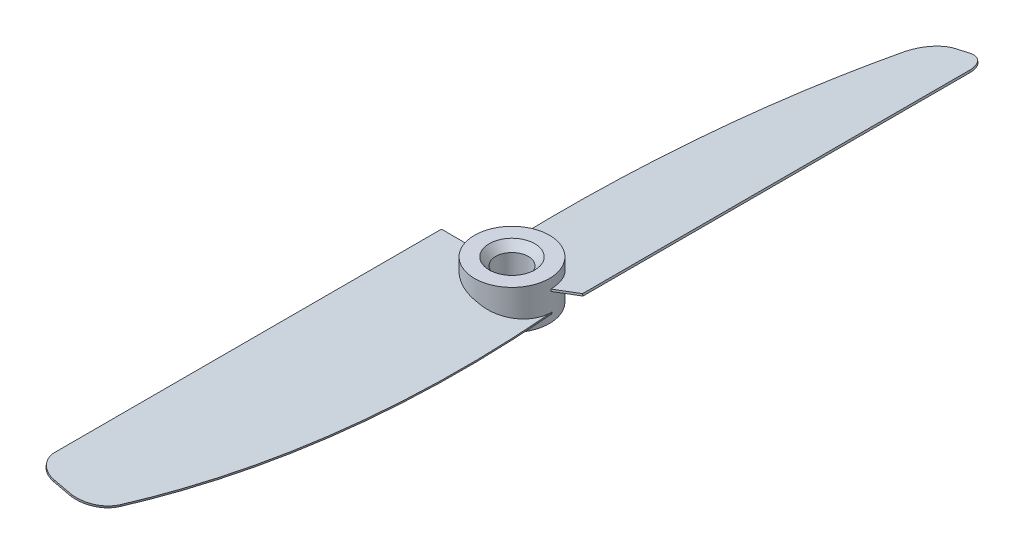
ISO-10303-21;
HEADER;
FILE_DESCRIPTION(('STEP AP214'),'2;1');
FILE_NAME('part.step','',(''),(''),'','','');
FILE_SCHEMA(('AUTOMOTIVE_DESIGN { 1 0 10303 214 1 1 1 1 }'));
ENDSEC;
DATA;
#1=APPLICATION_CONTEXT('core data for automotive mechanical design processes');
#2=APPLICATION_PROTOCOL_DEFINITION('international standard','automotive_design',2000,#1);
#3=PRODUCT_CONTEXT('',#1,'mechanical');
#4=PRODUCT('Part','Part','',(#3));
#5=PRODUCT_RELATED_PRODUCT_CATEGORY('part','',(#4));
#6=PRODUCT_DEFINITION_FORMATION('','',#4);
#7=PRODUCT_DEFINITION_CONTEXT('part definition',#1,'design');
#8=PRODUCT_DEFINITION('design','',#6,#7);
#9=PRODUCT_DEFINITION_SHAPE('','',#8);
#10=(LENGTH_UNIT() NAMED_UNIT(*) SI_UNIT(.MILLI.,.METRE.));
#11=(NAMED_UNIT(*) PLANE_ANGLE_UNIT() SI_UNIT($,.RADIAN.));
#12=(NAMED_UNIT(*) SI_UNIT($,.STERADIAN.) SOLID_ANGLE_UNIT());
#13=UNCERTAINTY_MEASURE_WITH_UNIT(LENGTH_MEASURE(1.E-05),#10,'distance_accuracy_value','');
#14=(GEOMETRIC_REPRESENTATION_CONTEXT(3) GLOBAL_UNCERTAINTY_ASSIGNED_CONTEXT((#13)) GLOBAL_UNIT_ASSIGNED_CONTEXT((#10,
#11,#12)) REPRESENTATION_CONTEXT('',''));
#15=CARTESIAN_POINT('',(0.,0.,0.));
#16=DIRECTION('',(0.,0.,1.));
#17=DIRECTION('',(1.,0.,0.));
#18=AXIS2_PLACEMENT_3D('',#15,#16,#17);
#19=CARTESIAN_POINT('',(0.,3.,0.));
#20=DIRECTION('',(0.,-1.,0.));
#21=DIRECTION('',(0.,0.,-1.));
#22=AXIS2_PLACEMENT_3D('',#19,#20,#21);
#23=CYLINDRICAL_SURFACE('',#22,5.75);
#24=CARTESIAN_POINT('',(0.,-0.153945616169009,0.));
#25=DIRECTION('',(0.224951054343865,0.974370064785235,0.));
#26=DIRECTION('',(0.974370064785235,-0.224951054343865,0.));
#27=AXIS2_PLACEMENT_3D('',#24,#25,#26);
#28=ELLIPSE('',#27,5.901248619812,5.75);
#29=CARTESIAN_POINT('',(-5.74624775209411,1.17268020811629,0.207693937208976));
#30=VERTEX_POINT('',#29);
#31=CARTESIAN_POINT('',(0.320003598356016,-0.227824268075133,5.74108854635071));
#32=VERTEX_POINT('',#31);
#33=EDGE_CURVE('E431',#30,#32,#28,.T.);
#34=ORIENTED_EDGE('',*,*,#33,.F.);
#35=CARTESIAN_POINT('',(0.,21.9059862771338,0.));
#36=DIRECTION('',(0.211290830005462,-0.0487803317247799,0.976205236818787));
#37=DIRECTION('',(-0.0103191213720659,-0.998809531010202,-0.0476763725265266));
#38=AXIS2_PLACEMENT_3D('',#35,#36,#37);
#39=ELLIPSE('',#38,117.875377159009,5.75);
#40=CARTESIAN_POINT('',(-5.74567610132228,1.48043946447466,0.222948735573927));
#41=VERTEX_POINT('',#40);
#42=EDGE_CURVE('E428',#41,#30,#39,.T.);
#43=ORIENTED_EDGE('',*,*,#42,.F.);
#44=CARTESIAN_POINT('',(0.,0.153945616169008,0.));
#45=DIRECTION('',(0.224951054343865,0.974370064785235,0.));
#46=DIRECTION('',(0.974370064785235,-0.224951054343865,0.));
#47=AXIS2_PLACEMENT_3D('',#44,#45,#46);
#48=ELLIPSE('',#47,5.901248619812,5.75);
#49=CARTESIAN_POINT('',(0.354622157583118,0.0720746401147498,5.73905420129059));
#50=VERTEX_POINT('',#49);
#51=EDGE_CURVE('E420',#41,#50,#48,.T.);
#52=ORIENTED_EDGE('',*,*,#51,.T.);
#53=CARTESIAN_POINT('',(0.320003598355667,-0.227824268075053,5.7410885463507));
#54=CARTESIAN_POINT('',(0.325773371717421,-0.177840999841731,5.74076694689687));
#55=CARTESIAN_POINT('',(0.331543138333911,-0.127857790042578,5.74043661841495));
#56=CARTESIAN_POINT('',(0.343082658076362,-0.0278914873126147,5.73975850339491));
#57=CARTESIAN_POINT('',(0.348852411202323,0.0220916056181969,5.7394107168568));
#58=CARTESIAN_POINT('',(0.35462215758302,0.0720746401148383,5.73905420129059));
#59=B_SPLINE_CURVE_WITH_KNOTS('',3,(#53,#54,#55,#56,#57,#58),.UNSPECIFIED.,.F.,.F.,(4,2,4),(0.,
0.150948617979321,0.301897235958643),.UNSPECIFIED.);
#60=EDGE_CURVE('E236',#32,#50,#59,.T.);
#61=ORIENTED_EDGE('',*,*,#60,.F.);
#62=EDGE_LOOP('',(#34,#43,#52,#61));
#63=FACE_BOUND('',#62,.T.);
#64=CARTESIAN_POINT('',(0.,3.,0.));
#65=DIRECTION('',(0.,1.,0.));
#66=DIRECTION('',(0.,0.,1.));
#67=AXIS2_PLACEMENT_3D('',#64,#65,#66);
#68=CIRCLE('',#67,5.75);
#69=CARTESIAN_POINT('',(0.,3.,5.75));
#70=VERTEX_POINT('',#69);
#71=EDGE_CURVE('E416',#70,#70,#68,.T.);
#72=ORIENTED_EDGE('',*,*,#71,.F.);
#73=EDGE_LOOP('',(#72));
#74=FACE_BOUND('',#73,.T.);
#75=CARTESIAN_POINT('',(0.,-3.,0.));
#76=DIRECTION('',(0.,1.,0.));
#77=DIRECTION('',(0.,0.,1.));
#78=AXIS2_PLACEMENT_3D('',#75,#76,#77);
#79=CIRCLE('',#78,5.75);
#80=CARTESIAN_POINT('',(0.,-3.,5.75));
#81=VERTEX_POINT('',#80);
#82=EDGE_CURVE('E415',#81,#81,#79,.T.);
#83=ORIENTED_EDGE('',*,*,#82,.T.);
#84=EDGE_LOOP('',(#83));
#85=FACE_BOUND('',#84,.T.);
#86=CARTESIAN_POINT('',(0.,-0.153945616169009,0.));
#87=DIRECTION('',(-0.224951054343865,0.974370064785235,0.));
#88=DIRECTION('',(-0.974370064785235,-0.224951054343865,0.));
#89=AXIS2_PLACEMENT_3D('',#86,#87,#88);
#90=ELLIPSE('',#89,5.901248619812,5.75);
#91=CARTESIAN_POINT('',(5.74624775209411,1.17268020811629,-0.207693937208976));
#92=VERTEX_POINT('',#91);
#93=CARTESIAN_POINT('',(-0.320003598356016,-0.227824268075133,-5.74108854635071));
#94=VERTEX_POINT('',#93);
#95=EDGE_CURVE('E441',#92,#94,#90,.T.);
#96=ORIENTED_EDGE('',*,*,#95,.F.);
#97=CARTESIAN_POINT('',(0.,21.9059862771338,0.));
#98=DIRECTION('',(-0.211290830005462,-0.0487803317247799,-0.976205236818787));
#99=DIRECTION('',(0.0103191213720659,-0.998809531010202,0.0476763725265266));
#100=AXIS2_PLACEMENT_3D('',#97,#98,#99);
#101=ELLIPSE('',#100,117.875377159009,5.75);
#102=CARTESIAN_POINT('',(5.74567610132228,1.48043946447466,-0.222948735573927));
#103=VERTEX_POINT('',#102);
#104=EDGE_CURVE('E254',#103,#92,#101,.T.);
#105=ORIENTED_EDGE('',*,*,#104,.F.);
#106=CARTESIAN_POINT('',(0.,0.153945616169008,0.));
#107=DIRECTION('',(-0.224951054343865,0.974370064785235,0.));
#108=DIRECTION('',(-0.974370064785235,-0.224951054343865,0.));
#109=AXIS2_PLACEMENT_3D('',#106,#107,#108);
#110=ELLIPSE('',#109,5.901248619812,5.75);
#111=CARTESIAN_POINT('',(-0.354622157583118,0.0720746401147498,-5.73905420129059));
#112=VERTEX_POINT('',#111);
#113=EDGE_CURVE('E255',#103,#112,#110,.T.);
#114=ORIENTED_EDGE('',*,*,#113,.T.);
#115=CARTESIAN_POINT('',(-0.320003598355667,-0.227824268075053,-5.7410885463507));
#116=CARTESIAN_POINT('',(-0.325773371717421,-0.177840999841731,-5.74076694689687));
#117=CARTESIAN_POINT('',(-0.331543138333911,-0.127857790042578,-5.74043661841495));
#118=CARTESIAN_POINT('',(-0.343082658076362,-0.0278914873126147,-5.73975850339491));
#119=CARTESIAN_POINT('',(-0.348852411202323,0.0220916056181969,-5.7394107168568));
#120=CARTESIAN_POINT('',(-0.35462215758302,0.0720746401148383,-5.73905420129059));
#121=B_SPLINE_CURVE_WITH_KNOTS('',3,(#115,#116,#117,#118,#119,#120),.UNSPECIFIED.,.F.,.F.,(4,2,
4),(0.,0.150948617979321,0.301897235958643),.UNSPECIFIED.);
#122=EDGE_CURVE('E245',#94,#112,#121,.T.);
#123=ORIENTED_EDGE('',*,*,#122,.F.);
#124=EDGE_LOOP('',(#96,#105,#114,#123));
#125=FACE_BOUND('',#124,.T.);
#126=ADVANCED_FACE('F47',(#63,#74,#85,#125),#23,.T.);
#127=CARTESIAN_POINT('',(0.,3.,0.));
#128=DIRECTION('',(0.,1.,0.));
#129=DIRECTION('',(0.,0.,1.));
#130=AXIS2_PLACEMENT_3D('',#127,#128,#129);
#131=PLANE('',#130);
#132=CARTESIAN_POINT('',(0.,3.,0.));
#133=DIRECTION('',(0.,1.,0.));
#134=DIRECTION('',(0.,0.,1.));
#135=AXIS2_PLACEMENT_3D('',#132,#133,#134);
#136=CIRCLE('',#135,3.5);
#137=CARTESIAN_POINT('',(0.,3.,3.5));
#138=VERTEX_POINT('',#137);
#139=EDGE_CURVE('E57',#138,#138,#136,.F.);
#140=ORIENTED_EDGE('',*,*,#139,.T.);
#141=EDGE_LOOP('',(#140));
#142=FACE_BOUND('',#141,.T.);
#143=ORIENTED_EDGE('',*,*,#71,.T.);
#144=EDGE_LOOP('',(#143));
#145=FACE_BOUND('',#144,.T.);
#146=ADVANCED_FACE('F221',(#142,#145),#131,.T.);
#147=CARTESIAN_POINT('',(0.,-3.,0.));
#148=DIRECTION('',(0.,1.,0.));
#149=DIRECTION('',(0.,0.,1.));
#150=AXIS2_PLACEMENT_3D('',#147,#148,#149);
#151=PLANE('',#150);
#152=CARTESIAN_POINT('',(0.,-3.,0.));
#153=DIRECTION('',(0.,1.,0.));
#154=DIRECTION('',(0.,0.,1.));
#155=AXIS2_PLACEMENT_3D('',#152,#153,#154);
#156=CIRCLE('',#155,3.69175359259424);
#157=CARTESIAN_POINT('',(0.,-3.,3.69175359259424));
#158=VERTEX_POINT('',#157);
#159=EDGE_CURVE('E11',#158,#158,#156,.T.);
#160=ORIENTED_EDGE('',*,*,#159,.T.);
#161=EDGE_LOOP('',(#160));
#162=FACE_BOUND('',#161,.T.);
#163=ORIENTED_EDGE('',*,*,#82,.F.);
#164=EDGE_LOOP('',(#163));
#165=FACE_BOUND('',#164,.T.);
#166=ADVANCED_FACE('F224',(#162,#165),#151,.F.);
#167=CARTESIAN_POINT('',(0.623814062032038,-0.297964440269035,0.));
#168=DIRECTION('',(0.224951054343865,0.974370064785235,0.));
#169=DIRECTION('',(0.,0.,1.));
#170=AXIS2_PLACEMENT_3D('',#167,#168,#169);
#171=ELLIPSE('',#170,5.75,5.6026278725151);
#172=DIRECTION('',(0.224951054343865,0.974370064785235,0.));
#173=VECTOR('',#172,1.);
#174=SURFACE_OF_LINEAR_EXTRUSION('',#171,#173);
#175=CARTESIAN_POINT('',(6.08284694514214,-1.55828148728764,0.));
#176=VERTEX_POINT('',#175);
#177=EDGE_CURVE('E362',#32,#176,#171,.T.);
#178=ORIENTED_EDGE('',*,*,#177,.F.);
#179=ORIENTED_EDGE('',*,*,#60,.T.);
#180=CARTESIAN_POINT('',(0.691299378335197,-0.00565342083346486,0.));
#181=DIRECTION('',(0.224951054343865,0.974370064785235,0.));
#182=DIRECTION('',(0.,0.,1.));
#183=AXIS2_PLACEMENT_3D('',#180,#181,#182);
#184=ELLIPSE('',#183,5.75,5.6026278725151);
#185=CARTESIAN_POINT('',(6.1503322614453,-1.26597046785206,0.));
#186=VERTEX_POINT('',#185);
#187=EDGE_CURVE('E72',#50,#186,#184,.T.);
#188=ORIENTED_EDGE('',*,*,#187,.T.);
#189=DIRECTION('',(0.224951054343865,0.974370064785235,0.));
#190=VECTOR('',#189,1.);
#191=CARTESIAN_POINT('',(6.08284694514214,-1.55828148728764,0.));
#192=LINE('',#191,#190);
#193=EDGE_CURVE('E366',#176,#186,#192,.T.);
#194=ORIENTED_EDGE('',*,*,#193,.F.);
#195=EDGE_LOOP('',(#178,#179,#188,#194));
#196=FACE_BOUND('',#195,.T.);
#197=ADVANCED_FACE('F218',(#196),#174,.F.);
#198=CARTESIAN_POINT('',(6.08284694514214,-1.55828148728764,0.));
#199=CARTESIAN_POINT('',(7.46496579437923,-1.87736876593155,19.9705696622409));
#200=CARTESIAN_POINT('',(6.1640454179794,-1.57702763183373,41.0308337196066));
#201=CARTESIAN_POINT('',(-0.018742254254453,-0.149618625831668,60.1047436704453));
#202=B_SPLINE_CURVE_WITH_KNOTS('',3,(#198,#199,#200,#201),.UNSPECIFIED.,.F.,.F.,(4,4),(0.,
0.936918572236021),.UNSPECIFIED.);
#203=DIRECTION('',(0.224951054343865,0.974370064785235,0.));
#204=VECTOR('',#203,1.);
#205=SURFACE_OF_LINEAR_EXTRUSION('',#202,#204);
#206=CARTESIAN_POINT('',(6.1503322614453,-1.26597046785206,0.));
#207=CARTESIAN_POINT('',(7.53245111068239,-1.58505774649598,19.9705696622409));
#208=CARTESIAN_POINT('',(6.23153073428256,-1.28471661239816,41.0308337196066));
#209=CARTESIAN_POINT('',(0.0487430620487066,0.142692393603903,60.1047436704453));
#210=B_SPLINE_CURVE_WITH_KNOTS('',3,(#206,#207,#208,#209),.UNSPECIFIED.,.F.,.F.,(4,4),(0.,
0.936918572236021),.UNSPECIFIED.);
#211=CARTESIAN_POINT('',(0.0487430620487076,0.142692393603902,60.1047436704453));
#212=VERTEX_POINT('',#211);
#213=EDGE_CURVE('E189',#186,#212,#210,.T.);
#214=ORIENTED_EDGE('',*,*,#213,.T.);
#215=DIRECTION('',(0.224951054343865,0.974370064785235,0.));
#216=VECTOR('',#215,1.);
#217=CARTESIAN_POINT('',(-0.018742254254452,-0.149618625831668,60.1047436704453));
#218=LINE('',#217,#216);
#219=CARTESIAN_POINT('',(-0.018742254254452,-0.149618625831668,60.1047436704453));
#220=VERTEX_POINT('',#219);
#221=EDGE_CURVE('E411',#220,#212,#218,.T.);
#222=ORIENTED_EDGE('',*,*,#221,.F.);
#223=EDGE_CURVE('E200',#176,#220,#202,.T.);
#224=ORIENTED_EDGE('',*,*,#223,.F.);
#225=ORIENTED_EDGE('',*,*,#193,.T.);
#226=EDGE_LOOP('',(#214,#222,#224,#225));
#227=FACE_BOUND('',#226,.T.);
#228=ADVANCED_FACE('F213',(#227),#205,.F.);
#229=CARTESIAN_POINT('',(-4.64149693307499,0.917628384884866,58.5264144913577));
#230=DIRECTION('',(0.224951054343865,0.974370064785235,0.));
#231=DIRECTION('',(-0.974370064785235,0.224951054343865,0.));
#232=AXIS2_PLACEMENT_3D('',#229,#230,#231);
#233=CYLINDRICAL_SURFACE('',#232,5.);
#234=CARTESIAN_POINT('',(-4.57401161677183,1.20993940432044,58.5264144913577));
#235=DIRECTION('',(-0.224951054343865,-0.974370064785235,0.));
#236=DIRECTION('',(0.974370064785235,-0.224951054343865,0.));
#237=AXIS2_PLACEMENT_3D('',#234,#235,#236);
#238=CIRCLE('',#237,5.);
#239=CARTESIAN_POINT('',(-4.07389565396318,1.09447853663378,63.5));
#240=VERTEX_POINT('',#239);
#241=EDGE_CURVE('E194',#212,#240,#238,.T.);
#242=ORIENTED_EDGE('',*,*,#241,.T.);
#243=DIRECTION('',(0.224951054343865,0.974370064785235,0.));
#244=VECTOR('',#243,1.);
#245=CARTESIAN_POINT('',(-4.14138097026634,0.802167517198213,63.5));
#246=LINE('',#245,#244);
#247=CARTESIAN_POINT('',(-4.14138097026634,0.802167517198213,63.5));
#248=VERTEX_POINT('',#247);
#249=EDGE_CURVE('E407',#248,#240,#246,.T.);
#250=ORIENTED_EDGE('',*,*,#249,.F.);
#251=CARTESIAN_POINT('',(-4.64149693307499,0.917628384884866,58.5264144913577));
#252=DIRECTION('',(-0.224951054343865,-0.974370064785235,0.));
#253=DIRECTION('',(0.974370064785235,-0.224951054343865,0.));
#254=AXIS2_PLACEMENT_3D('',#251,#252,#253);
#255=CIRCLE('',#254,5.);
#256=EDGE_CURVE('E207',#220,#248,#255,.T.);
#257=ORIENTED_EDGE('',*,*,#256,.F.);
#258=ORIENTED_EDGE('',*,*,#221,.T.);
#259=EDGE_LOOP('',(#242,#250,#257,#258));
#260=FACE_BOUND('',#259,.T.);
#261=ADVANCED_FACE('F217',(#260),#233,.T.);
#262=CARTESIAN_POINT('',(-6.84556677080153,1.42647800143521,63.5));
#263=DIRECTION('',(0.,0.,-1.));
#264=DIRECTION('',(-1.,0.,0.));
#265=AXIS2_PLACEMENT_3D('',#262,#263,#264);
#266=PLANE('',#265);
#267=DIRECTION('',(-0.974370064785235,0.224951054343865,0.));
#268=VECTOR('',#267,1.);
#269=CARTESIAN_POINT('',(-6.77808145449838,1.71878902087078,63.5));
#270=LINE('',#269,#268);
#271=CARTESIAN_POINT('',(-6.77808145449838,1.71878902087078,63.5));
#272=VERTEX_POINT('',#271);
#273=EDGE_CURVE('E377',#240,#272,#270,.T.);
#274=ORIENTED_EDGE('',*,*,#273,.T.);
#275=DIRECTION('',(0.224951054343865,0.974370064785235,0.));
#276=VECTOR('',#275,1.);
#277=CARTESIAN_POINT('',(-6.84556677080154,1.42647800143521,63.5));
#278=LINE('',#277,#276);
#279=CARTESIAN_POINT('',(-6.84556677080154,1.42647800143521,63.5));
#280=VERTEX_POINT('',#279);
#281=EDGE_CURVE('E403',#280,#272,#278,.T.);
#282=ORIENTED_EDGE('',*,*,#281,.F.);
#283=DIRECTION('',(-0.974370064785235,0.224951054343865,0.));
#284=VECTOR('',#283,1.);
#285=CARTESIAN_POINT('',(-6.84556677080153,1.42647800143521,63.5));
#286=LINE('',#285,#284);
#287=EDGE_CURVE('E644',#248,#280,#286,.T.);
#288=ORIENTED_EDGE('',*,*,#287,.F.);
#289=ORIENTED_EDGE('',*,*,#249,.T.);
#290=EDGE_LOOP('',(#274,#282,#288,#289));
#291=FACE_BOUND('',#290,.T.);
#292=ADVANCED_FACE('F587',(#291),#266,.F.);
#293=CARTESIAN_POINT('',(-6.84556677080156,1.42647800143521,60.5));
#294=DIRECTION('',(0.224951054343865,0.974370064785235,0.));
#295=DIRECTION('',(-0.974370064785235,0.224951054343865,0.));
#296=AXIS2_PLACEMENT_3D('',#293,#294,#295);
#297=CYLINDRICAL_SURFACE('',#296,3.);
#298=CARTESIAN_POINT('',(-6.7780814544984,1.71878902087078,60.5));
#299=DIRECTION('',(-0.224951054343865,-0.974370064785235,0.));
#300=DIRECTION('',(-0.974370064785235,0.224951054343865,0.));
#301=AXIS2_PLACEMENT_3D('',#298,#299,#300);
#302=CIRCLE('',#301,3.);
#303=CARTESIAN_POINT('',(-9.7011916488541,2.39364218390238,60.5));
#304=VERTEX_POINT('',#303);
#305=EDGE_CURVE('E380',#272,#304,#302,.T.);
#306=ORIENTED_EDGE('',*,*,#305,.T.);
#307=DIRECTION('',(0.224951054343865,0.974370064785235,0.));
#308=VECTOR('',#307,1.);
#309=CARTESIAN_POINT('',(-9.76867696515726,2.10133116446681,60.5));
#310=LINE('',#309,#308);
#311=CARTESIAN_POINT('',(-9.76867696515726,2.10133116446681,60.5));
#312=VERTEX_POINT('',#311);
#313=EDGE_CURVE('E399',#312,#304,#310,.T.);
#314=ORIENTED_EDGE('',*,*,#313,.F.);
#315=CARTESIAN_POINT('',(-6.84556677080156,1.42647800143521,60.5));
#316=DIRECTION('',(-0.224951054343865,-0.974370064785235,0.));
#317=DIRECTION('',(-0.974370064785235,0.224951054343865,0.));
#318=AXIS2_PLACEMENT_3D('',#315,#316,#317);
#319=CIRCLE('',#318,3.);
#320=EDGE_CURVE('E654',#280,#312,#319,.T.);
#321=ORIENTED_EDGE('',*,*,#320,.F.);
#322=ORIENTED_EDGE('',*,*,#281,.T.);
#323=EDGE_LOOP('',(#306,#314,#321,#322));
#324=FACE_BOUND('',#323,.T.);
#325=ADVANCED_FACE('F579',(#324),#297,.T.);
#326=CARTESIAN_POINT('',(-9.76867696515726,2.10133116446681,1.12471658266301));
#327=DIRECTION('',(0.974370064785235,-0.224951054343865,0.));
#328=DIRECTION('',(0.224951054343865,0.974370064785235,0.));
#329=AXIS2_PLACEMENT_3D('',#326,#327,#328);
#330=PLANE('',#329);
#331=DIRECTION('',(0.,0.,-1.));
#332=VECTOR('',#331,1.);
#333=CARTESIAN_POINT('',(-9.7011916488541,2.39364218390238,1.12471658266301));
#334=LINE('',#333,#332);
#335=CARTESIAN_POINT('',(-9.7011916488541,2.39364218390238,1.12471658266301));
#336=VERTEX_POINT('',#335);
#337=EDGE_CURVE('E383',#304,#336,#334,.T.);
#338=ORIENTED_EDGE('',*,*,#337,.T.);
#339=DIRECTION('',(0.224951054343865,0.974370064785235,0.));
#340=VECTOR('',#339,1.);
#341=CARTESIAN_POINT('',(-9.76867696515726,2.10133116446681,1.12471658266301));
#342=LINE('',#341,#340);
#343=CARTESIAN_POINT('',(-9.76867696515726,2.10133116446681,1.12471658266301));
#344=VERTEX_POINT('',#343);
#345=EDGE_CURVE('E395',#344,#336,#342,.T.);
#346=ORIENTED_EDGE('',*,*,#345,.F.);
#347=DIRECTION('',(0.,0.,-1.));
#348=VECTOR('',#347,1.);
#349=CARTESIAN_POINT('',(-9.76867696515726,2.10133116446681,1.12471658266301));
#350=LINE('',#349,#348);
#351=EDGE_CURVE('E652',#312,#344,#350,.T.);
#352=ORIENTED_EDGE('',*,*,#351,.F.);
#353=ORIENTED_EDGE('',*,*,#313,.T.);
#354=EDGE_LOOP('',(#338,#346,#352,#353));
#355=FACE_BOUND('',#354,.T.);
#356=ADVANCED_FACE('F572',(#355),#330,.F.);
#357=CARTESIAN_POINT('',(-4.83521882107807,0.962352606749565,0.));
#358=DIRECTION('',(0.211290830005462,-0.0487803317247799,0.976205236818787));
#359=DIRECTION('',(0.977368764023954,0.,-0.211542664988149));
#360=AXIS2_PLACEMENT_3D('',#357,#358,#359);
#361=PLANE('',#360);
#362=DIRECTION('',(0.951185159842807,-0.219598397278389,-0.216848646773681));
#363=VECTOR('',#362,1.);
#364=CARTESIAN_POINT('',(-4.76773350477491,1.25466362618513,0.));
#365=LINE('',#364,#363);
#366=EDGE_CURVE('E386',#336,#41,#365,.T.);
#367=ORIENTED_EDGE('',*,*,#366,.T.);
#368=ORIENTED_EDGE('',*,*,#42,.T.);
#369=DIRECTION('',(0.951185159842807,-0.219598397278389,-0.216848646773681));
#370=VECTOR('',#369,1.);
#371=CARTESIAN_POINT('',(-4.83521882107807,0.962352606749565,0.));
#372=LINE('',#371,#370);
#373=EDGE_CURVE('E367',#344,#30,#372,.T.);
#374=ORIENTED_EDGE('',*,*,#373,.F.);
#375=ORIENTED_EDGE('',*,*,#345,.T.);
#376=EDGE_LOOP('',(#367,#368,#374,#375));
#377=FACE_BOUND('',#376,.T.);
#378=ADVANCED_FACE('F353',(#377),#361,.F.);
#379=CARTESIAN_POINT('',(5.86889229099545,-1.50888616330189,30.3886192269985));
#380=DIRECTION('',(0.224951054343865,0.974370064785235,0.));
#381=DIRECTION('',(-0.974370064785235,0.224951054343865,0.));
#382=AXIS2_PLACEMENT_3D('',#379,#380,#381);
#383=PLANE('',#382);
#384=ORIENTED_EDGE('',*,*,#373,.T.);
#385=ORIENTED_EDGE('',*,*,#33,.T.);
#386=ORIENTED_EDGE('',*,*,#177,.T.);
#387=ORIENTED_EDGE('',*,*,#223,.T.);
#388=ORIENTED_EDGE('',*,*,#256,.T.);
#389=ORIENTED_EDGE('',*,*,#287,.T.);
#390=ORIENTED_EDGE('',*,*,#320,.T.);
#391=ORIENTED_EDGE('',*,*,#351,.T.);
#392=EDGE_LOOP('',(#384,#385,#386,#387,#388,#389,#390,#391));
#393=FACE_BOUND('',#392,.T.);
#394=ADVANCED_FACE('F350',(#393),#383,.F.);
#395=CARTESIAN_POINT('',(5.93637760729861,-1.21657514386632,30.3886192269985));
#396=DIRECTION('',(0.224951054343865,0.974370064785235,0.));
#397=DIRECTION('',(-0.974370064785235,0.224951054343865,0.));
#398=AXIS2_PLACEMENT_3D('',#395,#396,#397);
#399=PLANE('',#398);
#400=ORIENTED_EDGE('',*,*,#51,.F.);
#401=ORIENTED_EDGE('',*,*,#366,.F.);
#402=ORIENTED_EDGE('',*,*,#337,.F.);
#403=ORIENTED_EDGE('',*,*,#305,.F.);
#404=ORIENTED_EDGE('',*,*,#273,.F.);
#405=ORIENTED_EDGE('',*,*,#241,.F.);
#406=ORIENTED_EDGE('',*,*,#213,.F.);
#407=ORIENTED_EDGE('',*,*,#187,.F.);
#408=EDGE_LOOP('',(#400,#401,#402,#403,#404,#405,#406,#407));
#409=FACE_BOUND('',#408,.T.);
#410=ADVANCED_FACE('F264',(#409),#399,.T.);
#411=CARTESIAN_POINT('',(-0.623814062032038,-0.297964440269035,0.));
#412=DIRECTION('',(-0.224951054343865,0.974370064785235,0.));
#413=DIRECTION('',(0.,0.,-1.));
#414=AXIS2_PLACEMENT_3D('',#411,#412,#413);
#415=ELLIPSE('',#414,5.75,5.6026278725151);
#416=DIRECTION('',(-0.224951054343865,0.974370064785235,0.));
#417=VECTOR('',#416,1.);
#418=SURFACE_OF_LINEAR_EXTRUSION('',#415,#417);
#419=CARTESIAN_POINT('',(-6.08284694514214,-1.55828148728764,0.));
#420=VERTEX_POINT('',#419);
#421=EDGE_CURVE('E180',#94,#420,#415,.T.);
#422=ORIENTED_EDGE('',*,*,#421,.F.);
#423=ORIENTED_EDGE('',*,*,#122,.T.);
#424=CARTESIAN_POINT('',(-0.691299378335197,-0.00565342083346486,0.));
#425=DIRECTION('',(-0.224951054343865,0.974370064785235,0.));
#426=DIRECTION('',(0.,0.,-1.));
#427=AXIS2_PLACEMENT_3D('',#424,#425,#426);
#428=ELLIPSE('',#427,5.75,5.6026278725151);
#429=CARTESIAN_POINT('',(-6.1503322614453,-1.26597046785206,0.));
#430=VERTEX_POINT('',#429);
#431=EDGE_CURVE('E64',#112,#430,#428,.T.);
#432=ORIENTED_EDGE('',*,*,#431,.T.);
#433=DIRECTION('',(-0.224951054343865,0.974370064785235,0.));
#434=VECTOR('',#433,1.);
#435=CARTESIAN_POINT('',(-6.08284694514214,-1.55828148728764,0.));
#436=LINE('',#435,#434);
#437=EDGE_CURVE('E274',#420,#430,#436,.T.);
#438=ORIENTED_EDGE('',*,*,#437,.F.);
#439=EDGE_LOOP('',(#422,#423,#432,#438));
#440=FACE_BOUND('',#439,.T.);
#441=ADVANCED_FACE('F258',(#440),#418,.F.);
#442=CARTESIAN_POINT('',(-6.08284694514214,-1.55828148728764,0.));
#443=CARTESIAN_POINT('',(-7.46496579437923,-1.87736876593155,-19.9705696622409));
#444=CARTESIAN_POINT('',(-6.1640454179794,-1.57702763183373,-41.0308337196066));
#445=CARTESIAN_POINT('',(0.018742254254453,-0.149618625831668,-60.1047436704453));
#446=B_SPLINE_CURVE_WITH_KNOTS('',3,(#442,#443,#444,#445),.UNSPECIFIED.,.F.,.F.,(4,4),(0.,
0.936918572236021),.UNSPECIFIED.);
#447=DIRECTION('',(-0.224951054343865,0.974370064785235,0.));
#448=VECTOR('',#447,1.);
#449=SURFACE_OF_LINEAR_EXTRUSION('',#446,#448);
#450=CARTESIAN_POINT('',(-6.1503322614453,-1.26597046785206,0.));
#451=CARTESIAN_POINT('',(-7.53245111068239,-1.58505774649598,-19.9705696622409));
#452=CARTESIAN_POINT('',(-6.23153073428256,-1.28471661239816,-41.0308337196066));
#453=CARTESIAN_POINT('',(-0.0487430620487066,0.142692393603903,-60.1047436704453));
#454=B_SPLINE_CURVE_WITH_KNOTS('',3,(#450,#451,#452,#453),.UNSPECIFIED.,.F.,.F.,(4,4),(0.,
0.936918572236021),.UNSPECIFIED.);
#455=CARTESIAN_POINT('',(-0.0487430620487076,0.142692393603902,-60.1047436704453));
#456=VERTEX_POINT('',#455);
#457=EDGE_CURVE('E187',#430,#456,#454,.T.);
#458=ORIENTED_EDGE('',*,*,#457,.T.);
#459=DIRECTION('',(-0.224951054343865,0.974370064785235,0.));
#460=VECTOR('',#459,1.);
#461=CARTESIAN_POINT('',(0.018742254254452,-0.149618625831668,-60.1047436704453));
#462=LINE('',#461,#460);
#463=CARTESIAN_POINT('',(0.018742254254452,-0.149618625831668,-60.1047436704453));
#464=VERTEX_POINT('',#463);
#465=EDGE_CURVE('E166',#464,#456,#462,.T.);
#466=ORIENTED_EDGE('',*,*,#465,.F.);
#467=EDGE_CURVE('E174',#420,#464,#446,.T.);
#468=ORIENTED_EDGE('',*,*,#467,.F.);
#469=ORIENTED_EDGE('',*,*,#437,.T.);
#470=EDGE_LOOP('',(#458,#466,#468,#469));
#471=FACE_BOUND('',#470,.T.);
#472=ADVANCED_FACE('F186',(#471),#449,.F.);
#473=CARTESIAN_POINT('',(4.64149693307499,0.917628384884866,-58.5264144913577));
#474=DIRECTION('',(-0.224951054343865,0.974370064785235,0.));
#475=DIRECTION('',(-0.974370064785235,-0.224951054343865,0.));
#476=AXIS2_PLACEMENT_3D('',#473,#474,#475);
#477=CYLINDRICAL_SURFACE('',#476,5.);
#478=CARTESIAN_POINT('',(4.57401161677183,1.20993940432044,-58.5264144913577));
#479=DIRECTION('',(0.224951054343865,-0.974370064785235,0.));
#480=DIRECTION('',(-0.974370064785235,-0.224951054343865,0.));
#481=AXIS2_PLACEMENT_3D('',#478,#479,#480);
#482=CIRCLE('',#481,5.);
#483=CARTESIAN_POINT('',(4.07389565396318,1.09447853663378,-63.5));
#484=VERTEX_POINT('',#483);
#485=EDGE_CURVE('E281',#456,#484,#482,.T.);
#486=ORIENTED_EDGE('',*,*,#485,.T.);
#487=DIRECTION('',(-0.224951054343865,0.974370064785235,0.));
#488=VECTOR('',#487,1.);
#489=CARTESIAN_POINT('',(4.14138097026634,0.802167517198213,-63.5));
#490=LINE('',#489,#488);
#491=CARTESIAN_POINT('',(4.14138097026634,0.802167517198213,-63.5));
#492=VERTEX_POINT('',#491);
#493=EDGE_CURVE('E169',#492,#484,#490,.T.);
#494=ORIENTED_EDGE('',*,*,#493,.F.);
#495=CARTESIAN_POINT('',(4.64149693307499,0.917628384884866,-58.5264144913577));
#496=DIRECTION('',(0.224951054343865,-0.974370064785235,0.));
#497=DIRECTION('',(-0.974370064785235,-0.224951054343865,0.));
#498=AXIS2_PLACEMENT_3D('',#495,#496,#497);
#499=CIRCLE('',#498,5.);
#500=EDGE_CURVE('E162',#464,#492,#499,.T.);
#501=ORIENTED_EDGE('',*,*,#500,.F.);
#502=ORIENTED_EDGE('',*,*,#465,.T.);
#503=EDGE_LOOP('',(#486,#494,#501,#502));
#504=FACE_BOUND('',#503,.T.);
#505=ADVANCED_FACE('F164',(#504),#477,.T.);
#506=CARTESIAN_POINT('',(6.84556677080153,1.42647800143521,-63.5));
#507=DIRECTION('',(0.,0.,1.));
#508=DIRECTION('',(1.,0.,0.));
#509=AXIS2_PLACEMENT_3D('',#506,#507,#508);
#510=PLANE('',#509);
#511=DIRECTION('',(0.974370064785235,0.224951054343865,0.));
#512=VECTOR('',#511,1.);
#513=CARTESIAN_POINT('',(6.77808145449838,1.71878902087078,-63.5));
#514=LINE('',#513,#512);
#515=CARTESIAN_POINT('',(6.77808145449838,1.71878902087078,-63.5));
#516=VERTEX_POINT('',#515);
#517=EDGE_CURVE('E287',#484,#516,#514,.T.);
#518=ORIENTED_EDGE('',*,*,#517,.T.);
#519=DIRECTION('',(-0.224951054343865,0.974370064785235,0.));
#520=VECTOR('',#519,1.);
#521=CARTESIAN_POINT('',(6.84556677080154,1.42647800143521,-63.5));
#522=LINE('',#521,#520);
#523=CARTESIAN_POINT('',(6.84556677080154,1.42647800143521,-63.5));
#524=VERTEX_POINT('',#523);
#525=EDGE_CURVE('E196',#524,#516,#522,.T.);
#526=ORIENTED_EDGE('',*,*,#525,.F.);
#527=DIRECTION('',(0.974370064785235,0.224951054343865,0.));
#528=VECTOR('',#527,1.);
#529=CARTESIAN_POINT('',(6.84556677080153,1.42647800143521,-63.5));
#530=LINE('',#529,#528);
#531=EDGE_CURVE('E173',#492,#524,#530,.T.);
#532=ORIENTED_EDGE('',*,*,#531,.F.);
#533=ORIENTED_EDGE('',*,*,#493,.T.);
#534=EDGE_LOOP('',(#518,#526,#532,#533));
#535=FACE_BOUND('',#534,.T.);
#536=ADVANCED_FACE('F527',(#535),#510,.F.);
#537=CARTESIAN_POINT('',(6.84556677080156,1.42647800143521,-60.5));
#538=DIRECTION('',(-0.224951054343865,0.974370064785235,0.));
#539=DIRECTION('',(-0.974370064785235,-0.224951054343865,0.));
#540=AXIS2_PLACEMENT_3D('',#537,#538,#539);
#541=CYLINDRICAL_SURFACE('',#540,3.);
#542=CARTESIAN_POINT('',(6.7780814544984,1.71878902087078,-60.5));
#543=DIRECTION('',(0.224951054343865,-0.974370064785235,0.));
#544=DIRECTION('',(0.974370064785235,0.224951054343865,0.));
#545=AXIS2_PLACEMENT_3D('',#542,#543,#544);
#546=CIRCLE('',#545,3.);
#547=CARTESIAN_POINT('',(9.7011916488541,2.39364218390238,-60.5));
#548=VERTEX_POINT('',#547);
#549=EDGE_CURVE('E290',#516,#548,#546,.T.);
#550=ORIENTED_EDGE('',*,*,#549,.T.);
#551=DIRECTION('',(-0.224951054343865,0.974370064785235,0.));
#552=VECTOR('',#551,1.);
#553=CARTESIAN_POINT('',(9.76867696515726,2.10133116446681,-60.5));
#554=LINE('',#553,#552);
#555=CARTESIAN_POINT('',(9.76867696515726,2.10133116446681,-60.5));
#556=VERTEX_POINT('',#555);
#557=EDGE_CURVE('E308',#556,#548,#554,.T.);
#558=ORIENTED_EDGE('',*,*,#557,.F.);
#559=CARTESIAN_POINT('',(6.84556677080156,1.42647800143521,-60.5));
#560=DIRECTION('',(0.224951054343865,-0.974370064785235,0.));
#561=DIRECTION('',(0.974370064785235,0.224951054343865,0.));
#562=AXIS2_PLACEMENT_3D('',#559,#560,#561);
#563=CIRCLE('',#562,3.);
#564=EDGE_CURVE('E319',#524,#556,#563,.T.);
#565=ORIENTED_EDGE('',*,*,#564,.F.);
#566=ORIENTED_EDGE('',*,*,#525,.T.);
#567=EDGE_LOOP('',(#550,#558,#565,#566));
#568=FACE_BOUND('',#567,.T.);
#569=ADVANCED_FACE('F317',(#568),#541,.T.);
#570=CARTESIAN_POINT('',(9.76867696515726,2.10133116446681,-1.12471658266301));
#571=DIRECTION('',(-0.974370064785235,-0.224951054343865,0.));
#572=DIRECTION('',(0.224951054343865,-0.974370064785235,0.));
#573=AXIS2_PLACEMENT_3D('',#570,#571,#572);
#574=PLANE('',#573);
#575=DIRECTION('',(0.,0.,1.));
#576=VECTOR('',#575,1.);
#577=CARTESIAN_POINT('',(9.7011916488541,2.39364218390238,-1.12471658266301));
#578=LINE('',#577,#576);
#579=CARTESIAN_POINT('',(9.7011916488541,2.39364218390238,-1.12471658266301));
#580=VERTEX_POINT('',#579);
#581=EDGE_CURVE('E293',#548,#580,#578,.T.);
#582=ORIENTED_EDGE('',*,*,#581,.T.);
#583=DIRECTION('',(-0.224951054343865,0.974370064785235,0.));
#584=VECTOR('',#583,1.);
#585=CARTESIAN_POINT('',(9.76867696515726,2.10133116446681,-1.12471658266301));
#586=LINE('',#585,#584);
#587=CARTESIAN_POINT('',(9.76867696515726,2.10133116446681,-1.12471658266301));
#588=VERTEX_POINT('',#587);
#589=EDGE_CURVE('E304',#588,#580,#586,.T.);
#590=ORIENTED_EDGE('',*,*,#589,.F.);
#591=DIRECTION('',(0.,0.,1.));
#592=VECTOR('',#591,1.);
#593=CARTESIAN_POINT('',(9.76867696515726,2.10133116446681,-1.12471658266301));
#594=LINE('',#593,#592);
#595=EDGE_CURVE('E333',#556,#588,#594,.T.);
#596=ORIENTED_EDGE('',*,*,#595,.F.);
#597=ORIENTED_EDGE('',*,*,#557,.T.);
#598=EDGE_LOOP('',(#582,#590,#596,#597));
#599=FACE_BOUND('',#598,.T.);
#600=ADVANCED_FACE('F326',(#599),#574,.F.);
#601=CARTESIAN_POINT('',(4.83521882107807,0.962352606749565,0.));
#602=DIRECTION('',(-0.211290830005462,-0.0487803317247799,-0.976205236818787));
#603=DIRECTION('',(-0.977368764023954,0.,0.211542664988149));
#604=AXIS2_PLACEMENT_3D('',#601,#602,#603);
#605=PLANE('',#604);
#606=DIRECTION('',(-0.951185159842807,-0.219598397278389,0.216848646773681));
#607=VECTOR('',#606,1.);
#608=CARTESIAN_POINT('',(4.76773350477491,1.25466362618513,0.));
#609=LINE('',#608,#607);
#610=EDGE_CURVE('E296',#580,#103,#609,.T.);
#611=ORIENTED_EDGE('',*,*,#610,.T.);
#612=ORIENTED_EDGE('',*,*,#104,.T.);
#613=DIRECTION('',(-0.951185159842807,-0.219598397278389,0.216848646773681));
#614=VECTOR('',#613,1.);
#615=CARTESIAN_POINT('',(4.83521882107807,0.962352606749565,0.));
#616=LINE('',#615,#614);
#617=EDGE_CURVE('E275',#588,#92,#616,.T.);
#618=ORIENTED_EDGE('',*,*,#617,.F.);
#619=ORIENTED_EDGE('',*,*,#589,.T.);
#620=EDGE_LOOP('',(#611,#612,#618,#619));
#621=FACE_BOUND('',#620,.T.);
#622=ADVANCED_FACE('F268',(#621),#605,.F.);
#623=CARTESIAN_POINT('',(-5.86889229099545,-1.50888616330189,-30.3886192269985));
#624=DIRECTION('',(-0.224951054343865,0.974370064785235,0.));
#625=DIRECTION('',(0.974370064785235,0.224951054343865,0.));
#626=AXIS2_PLACEMENT_3D('',#623,#624,#625);
#627=PLANE('',#626);
#628=ORIENTED_EDGE('',*,*,#617,.T.);
#629=ORIENTED_EDGE('',*,*,#95,.T.);
#630=ORIENTED_EDGE('',*,*,#421,.T.);
#631=ORIENTED_EDGE('',*,*,#467,.T.);
#632=ORIENTED_EDGE('',*,*,#500,.T.);
#633=ORIENTED_EDGE('',*,*,#531,.T.);
#634=ORIENTED_EDGE('',*,*,#564,.T.);
#635=ORIENTED_EDGE('',*,*,#595,.T.);
#636=EDGE_LOOP('',(#628,#629,#630,#631,#632,#633,#634,#635));
#637=FACE_BOUND('',#636,.T.);
#638=ADVANCED_FACE('F178',(#637),#627,.F.);
#639=CARTESIAN_POINT('',(-5.93637760729861,-1.21657514386632,-30.3886192269985));
#640=DIRECTION('',(-0.224951054343865,0.974370064785235,0.));
#641=DIRECTION('',(0.974370064785235,0.224951054343865,0.));
#642=AXIS2_PLACEMENT_3D('',#639,#640,#641);
#643=PLANE('',#642);
#644=ORIENTED_EDGE('',*,*,#113,.F.);
#645=ORIENTED_EDGE('',*,*,#610,.F.);
#646=ORIENTED_EDGE('',*,*,#581,.F.);
#647=ORIENTED_EDGE('',*,*,#549,.F.);
#648=ORIENTED_EDGE('',*,*,#517,.F.);
#649=ORIENTED_EDGE('',*,*,#485,.F.);
#650=ORIENTED_EDGE('',*,*,#457,.F.);
#651=ORIENTED_EDGE('',*,*,#431,.F.);
#652=EDGE_LOOP('',(#644,#645,#646,#647,#648,#649,#650,#651));
#653=FACE_BOUND('',#652,.T.);
#654=ADVANCED_FACE('F266',(#653),#643,.T.);
#655=CARTESIAN_POINT('',(0.,-3.,0.));
#656=DIRECTION('',(0.,1.,0.));
#657=DIRECTION('',(0.,0.,1.));
#658=AXIS2_PLACEMENT_3D('',#655,#656,#657);
#659=CYLINDRICAL_SURFACE('',#658,2.5);
#660=CARTESIAN_POINT('',(0.,1.80824640740578,0.));
#661=DIRECTION('',(0.,1.,0.));
#662=DIRECTION('',(0.,0.,1.));
#663=AXIS2_PLACEMENT_3D('',#660,#661,#662);
#664=CIRCLE('',#663,2.5);
#665=CARTESIAN_POINT('',(0.,1.80824640740578,2.5));
#666=VERTEX_POINT('',#665);
#667=EDGE_CURVE('E447',#666,#666,#664,.T.);
#668=ORIENTED_EDGE('',*,*,#667,.T.);
#669=EDGE_LOOP('',(#668));
#670=FACE_BOUND('',#669,.T.);
#671=CARTESIAN_POINT('',(0.,-1.99999999999997,0.));
#672=DIRECTION('',(0.,1.,0.));
#673=DIRECTION('',(0.,0.,1.));
#674=AXIS2_PLACEMENT_3D('',#671,#672,#673);
#675=CIRCLE('',#674,2.5);
#676=CARTESIAN_POINT('',(0.,-1.99999999999997,2.5));
#677=VERTEX_POINT('',#676);
#678=EDGE_CURVE('E444',#677,#677,#675,.F.);
#679=ORIENTED_EDGE('',*,*,#678,.T.);
#680=EDGE_LOOP('',(#679));
#681=FACE_BOUND('',#680,.T.);
#682=ADVANCED_FACE('F459',(#670,#681),#659,.F.);
#683=CARTESIAN_POINT('',(0.,1.80824640740578,0.));
#684=DIRECTION('',(0.,1.,0.));
#685=DIRECTION('',(0.,0.,1.));
#686=AXIS2_PLACEMENT_3D('',#683,#684,#685);
#687=CONICAL_SURFACE('',#686,2.5,0.69813170079773);
#688=ORIENTED_EDGE('',*,*,#139,.F.);
#689=EDGE_LOOP('',(#688));
#690=FACE_BOUND('',#689,.T.);
#691=ORIENTED_EDGE('',*,*,#667,.F.);
#692=EDGE_LOOP('',(#691));
#693=FACE_BOUND('',#692,.T.);
#694=ADVANCED_FACE('F233',(#690,#693),#687,.F.);
#695=CARTESIAN_POINT('',(0.,-3.,0.));
#696=DIRECTION('',(0.,-1.,0.));
#697=DIRECTION('',(0.,0.,-1.));
#698=AXIS2_PLACEMENT_3D('',#695,#696,#697);
#699=CONICAL_SURFACE('',#698,3.69175359259424,0.872664625997166);
#700=ORIENTED_EDGE('',*,*,#678,.F.);
#701=EDGE_LOOP('',(#700));
#702=FACE_BOUND('',#701,.T.);
#703=ORIENTED_EDGE('',*,*,#159,.F.);
#704=EDGE_LOOP('',(#703));
#705=FACE_BOUND('',#704,.T.);
#706=ADVANCED_FACE('F50',(#702,#705),#699,.F.);
#707=CLOSED_SHELL('',(#126,#146,#166,#197,#228,#261,#292,#325,#356,#378,#394,#410,#441,#472,
#505,#536,#569,#600,#622,#638,#654,#682,#694,#706));
#708=MANIFOLD_SOLID_BREP('B2',#707);
#709=ADVANCED_BREP_SHAPE_REPRESENTATION('',(#18,#708),#14);
#710=SHAPE_DEFINITION_REPRESENTATION(#9,#709);
ENDSEC;
END-ISO-10303-21;
